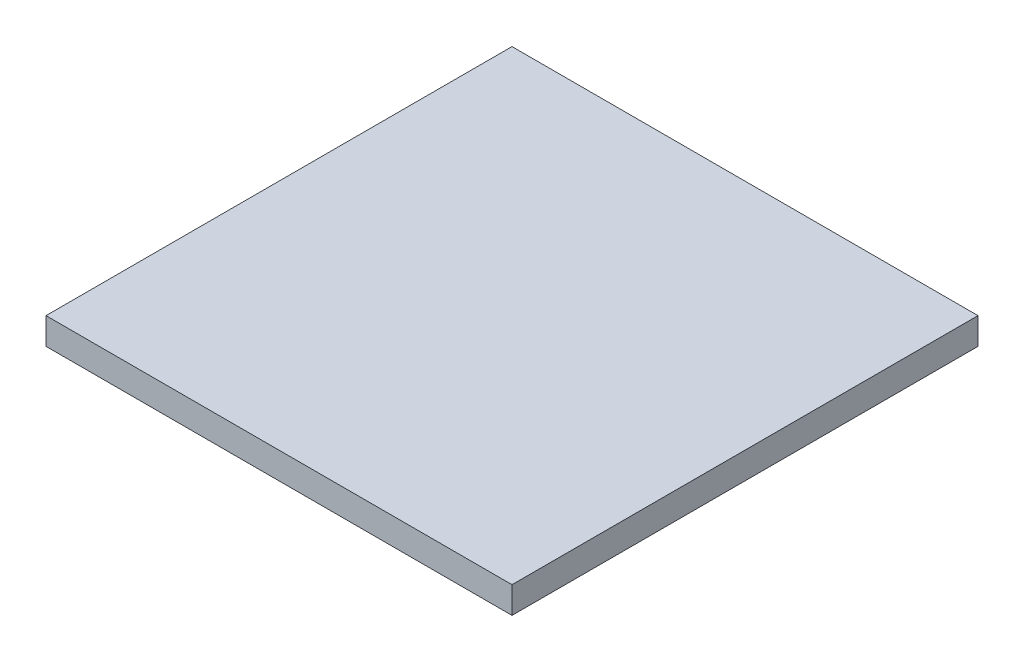
ISO-10303-21;
HEADER;
FILE_DESCRIPTION(('STEP AP214'),'2;1');
FILE_NAME('part.step','',(''),(''),'','','');
FILE_SCHEMA(('AUTOMOTIVE_DESIGN { 1 0 10303 214 1 1 1 1 }'));
ENDSEC;
DATA;
#1=APPLICATION_CONTEXT('core data for automotive mechanical design processes');
#2=APPLICATION_PROTOCOL_DEFINITION('international standard','automotive_design',2000,#1);
#3=PRODUCT_CONTEXT('',#1,'mechanical');
#4=PRODUCT('Part','Part','',(#3));
#5=PRODUCT_RELATED_PRODUCT_CATEGORY('part','',(#4));
#6=PRODUCT_DEFINITION_FORMATION('','',#4);
#7=PRODUCT_DEFINITION_CONTEXT('part definition',#1,'design');
#8=PRODUCT_DEFINITION('design','',#6,#7);
#9=PRODUCT_DEFINITION_SHAPE('','',#8);
#10=(LENGTH_UNIT() NAMED_UNIT(*) SI_UNIT(.MILLI.,.METRE.));
#11=(NAMED_UNIT(*) PLANE_ANGLE_UNIT() SI_UNIT($,.RADIAN.));
#12=(NAMED_UNIT(*) SI_UNIT($,.STERADIAN.) SOLID_ANGLE_UNIT());
#13=UNCERTAINTY_MEASURE_WITH_UNIT(LENGTH_MEASURE(1.E-05),#10,'distance_accuracy_value','');
#14=(GEOMETRIC_REPRESENTATION_CONTEXT(3) GLOBAL_UNCERTAINTY_ASSIGNED_CONTEXT((#13)) GLOBAL_UNIT_ASSIGNED_CONTEXT((#10,
#11,#12)) REPRESENTATION_CONTEXT('',''));
#15=CARTESIAN_POINT('',(0.,0.,0.));
#16=DIRECTION('',(0.,0.,1.));
#17=DIRECTION('',(1.,0.,0.));
#18=AXIS2_PLACEMENT_3D('',#15,#16,#17);
#19=CARTESIAN_POINT('',(-17.5,2.,-17.5));
#20=DIRECTION('',(1.,0.,0.));
#21=DIRECTION('',(0.,0.,-1.));
#22=AXIS2_PLACEMENT_3D('',#19,#20,#21);
#23=PLANE('',#22);
#24=DIRECTION('',(0.,0.,1.));
#25=VECTOR('',#24,1.);
#26=CARTESIAN_POINT('',(-17.5,0.,-17.5));
#27=LINE('',#26,#25);
#28=CARTESIAN_POINT('',(-17.5,0.,-17.5));
#29=VERTEX_POINT('',#28);
#30=CARTESIAN_POINT('',(-17.5,0.,17.5));
#31=VERTEX_POINT('',#30);
#32=EDGE_CURVE('E97',#29,#31,#27,.T.);
#33=ORIENTED_EDGE('',*,*,#32,.T.);
#34=DIRECTION('',(0.,-1.,0.));
#35=VECTOR('',#34,1.);
#36=CARTESIAN_POINT('',(-17.5,2.,17.5));
#37=LINE('',#36,#35);
#38=CARTESIAN_POINT('',(-17.5,2.,17.5));
#39=VERTEX_POINT('',#38);
#40=EDGE_CURVE('E11',#39,#31,#37,.T.);
#41=ORIENTED_EDGE('',*,*,#40,.F.);
#42=DIRECTION('',(0.,0.,1.));
#43=VECTOR('',#42,1.);
#44=CARTESIAN_POINT('',(-17.5,2.,-17.5));
#45=LINE('',#44,#43);
#46=CARTESIAN_POINT('',(-17.5,2.,-17.5));
#47=VERTEX_POINT('',#46);
#48=EDGE_CURVE('E85',#47,#39,#45,.T.);
#49=ORIENTED_EDGE('',*,*,#48,.F.);
#50=DIRECTION('',(0.,-1.,0.));
#51=VECTOR('',#50,1.);
#52=CARTESIAN_POINT('',(-17.5,2.,-17.5));
#53=LINE('',#52,#51);
#54=EDGE_CURVE('E93',#47,#29,#53,.T.);
#55=ORIENTED_EDGE('',*,*,#54,.T.);
#56=EDGE_LOOP('',(#33,#41,#49,#55));
#57=FACE_BOUND('',#56,.T.);
#58=ADVANCED_FACE('F34',(#57),#23,.F.);
#59=CARTESIAN_POINT('',(17.5,2.,17.5));
#60=DIRECTION('',(0.,0.,-1.));
#61=DIRECTION('',(-1.,0.,0.));
#62=AXIS2_PLACEMENT_3D('',#59,#60,#61);
#63=PLANE('',#62);
#64=DIRECTION('',(1.,0.,0.));
#65=VECTOR('',#64,1.);
#66=CARTESIAN_POINT('',(17.5,0.,17.5));
#67=LINE('',#66,#65);
#68=CARTESIAN_POINT('',(17.5,0.,17.5));
#69=VERTEX_POINT('',#68);
#70=EDGE_CURVE('E89',#31,#69,#67,.T.);
#71=ORIENTED_EDGE('',*,*,#70,.T.);
#72=DIRECTION('',(0.,-1.,0.));
#73=VECTOR('',#72,1.);
#74=CARTESIAN_POINT('',(17.5,2.,17.5));
#75=LINE('',#74,#73);
#76=CARTESIAN_POINT('',(17.5,2.,17.5));
#77=VERTEX_POINT('',#76);
#78=EDGE_CURVE('E42',#77,#69,#75,.T.);
#79=ORIENTED_EDGE('',*,*,#78,.F.);
#80=DIRECTION('',(1.,0.,0.));
#81=VECTOR('',#80,1.);
#82=CARTESIAN_POINT('',(17.5,2.,17.5));
#83=LINE('',#82,#81);
#84=EDGE_CURVE('E80',#39,#77,#83,.T.);
#85=ORIENTED_EDGE('',*,*,#84,.F.);
#86=ORIENTED_EDGE('',*,*,#40,.T.);
#87=EDGE_LOOP('',(#71,#79,#85,#86));
#88=FACE_BOUND('',#87,.T.);
#89=ADVANCED_FACE('F88',(#88),#63,.F.);
#90=CARTESIAN_POINT('',(17.5,2.,-17.5));
#91=DIRECTION('',(-1.,0.,0.));
#92=DIRECTION('',(0.,0.,1.));
#93=AXIS2_PLACEMENT_3D('',#90,#91,#92);
#94=PLANE('',#93);
#95=DIRECTION('',(0.,0.,-1.));
#96=VECTOR('',#95,1.);
#97=CARTESIAN_POINT('',(17.5,0.,-17.5));
#98=LINE('',#97,#96);
#99=CARTESIAN_POINT('',(17.5,0.,-17.5));
#100=VERTEX_POINT('',#99);
#101=EDGE_CURVE('E67',#69,#100,#98,.T.);
#102=ORIENTED_EDGE('',*,*,#101,.T.);
#103=DIRECTION('',(0.,-1.,0.));
#104=VECTOR('',#103,1.);
#105=CARTESIAN_POINT('',(17.5,2.,-17.5));
#106=LINE('',#105,#104);
#107=CARTESIAN_POINT('',(17.5,2.,-17.5));
#108=VERTEX_POINT('',#107);
#109=EDGE_CURVE('E90',#108,#100,#106,.T.);
#110=ORIENTED_EDGE('',*,*,#109,.F.);
#111=DIRECTION('',(0.,0.,-1.));
#112=VECTOR('',#111,1.);
#113=CARTESIAN_POINT('',(17.5,2.,-17.5));
#114=LINE('',#113,#112);
#115=EDGE_CURVE('E83',#77,#108,#114,.T.);
#116=ORIENTED_EDGE('',*,*,#115,.F.);
#117=ORIENTED_EDGE('',*,*,#78,.T.);
#118=EDGE_LOOP('',(#102,#110,#116,#117));
#119=FACE_BOUND('',#118,.T.);
#120=ADVANCED_FACE('F91',(#119),#94,.F.);
#121=CARTESIAN_POINT('',(17.5,2.,-17.5));
#122=DIRECTION('',(0.,0.,1.));
#123=DIRECTION('',(1.,0.,0.));
#124=AXIS2_PLACEMENT_3D('',#121,#122,#123);
#125=PLANE('',#124);
#126=DIRECTION('',(-1.,0.,0.));
#127=VECTOR('',#126,1.);
#128=CARTESIAN_POINT('',(17.5,0.,-17.5));
#129=LINE('',#128,#127);
#130=EDGE_CURVE('E73',#100,#29,#129,.T.);
#131=ORIENTED_EDGE('',*,*,#130,.T.);
#132=ORIENTED_EDGE('',*,*,#54,.F.);
#133=DIRECTION('',(-1.,0.,0.));
#134=VECTOR('',#133,1.);
#135=CARTESIAN_POINT('',(17.5,2.,-17.5));
#136=LINE('',#135,#134);
#137=EDGE_CURVE('E50',#108,#47,#136,.T.);
#138=ORIENTED_EDGE('',*,*,#137,.F.);
#139=ORIENTED_EDGE('',*,*,#109,.T.);
#140=EDGE_LOOP('',(#131,#132,#138,#139));
#141=FACE_BOUND('',#140,.T.);
#142=ADVANCED_FACE('F104',(#141),#125,.F.);
#143=CARTESIAN_POINT('',(0.,2.,0.));
#144=DIRECTION('',(0.,-1.,0.));
#145=DIRECTION('',(0.,0.,-1.));
#146=AXIS2_PLACEMENT_3D('',#143,#144,#145);
#147=PLANE('',#146);
#148=ORIENTED_EDGE('',*,*,#48,.T.);
#149=ORIENTED_EDGE('',*,*,#84,.T.);
#150=ORIENTED_EDGE('',*,*,#115,.T.);
#151=ORIENTED_EDGE('',*,*,#137,.T.);
#152=EDGE_LOOP('',(#148,#149,#150,#151));
#153=FACE_BOUND('',#152,.T.);
#154=ADVANCED_FACE('F81',(#153),#147,.F.);
#155=CARTESIAN_POINT('',(0.,0.,0.));
#156=DIRECTION('',(0.,-1.,0.));
#157=DIRECTION('',(0.,0.,-1.));
#158=AXIS2_PLACEMENT_3D('',#155,#156,#157);
#159=PLANE('',#158);
#160=ORIENTED_EDGE('',*,*,#32,.F.);
#161=ORIENTED_EDGE('',*,*,#130,.F.);
#162=ORIENTED_EDGE('',*,*,#101,.F.);
#163=ORIENTED_EDGE('',*,*,#70,.F.);
#164=EDGE_LOOP('',(#160,#161,#162,#163));
#165=FACE_BOUND('',#164,.T.);
#166=ADVANCED_FACE('F107',(#165),#159,.T.);
#167=CLOSED_SHELL('',(#58,#89,#120,#142,#154,#166));
#168=MANIFOLD_SOLID_BREP('B2',#167);
#169=ADVANCED_BREP_SHAPE_REPRESENTATION('',(#18,#168),#14);
#170=SHAPE_DEFINITION_REPRESENTATION(#9,#169);
ENDSEC;
END-ISO-10303-21;
